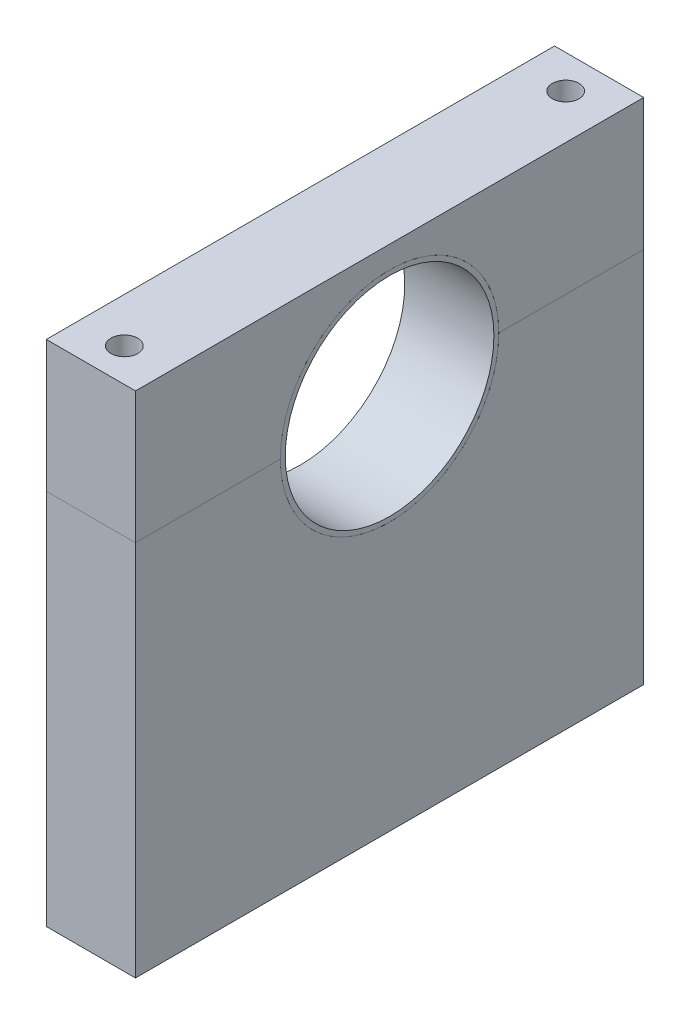
ISO-10303-21;
HEADER;
FILE_DESCRIPTION(('STEP AP214'),'2;1');
FILE_NAME('part.step','',(''),(''),'','','');
FILE_SCHEMA(('AUTOMOTIVE_DESIGN { 1 0 10303 214 1 1 1 1 }'));
ENDSEC;
DATA;
#1=APPLICATION_CONTEXT('core data for automotive mechanical design processes');
#2=APPLICATION_PROTOCOL_DEFINITION('international standard','automotive_design',2000,#1);
#3=PRODUCT_CONTEXT('',#1,'mechanical');
#4=PRODUCT('Part','Part','',(#3));
#5=PRODUCT_RELATED_PRODUCT_CATEGORY('part','',(#4));
#6=PRODUCT_DEFINITION_FORMATION('','',#4);
#7=PRODUCT_DEFINITION_CONTEXT('part definition',#1,'design');
#8=PRODUCT_DEFINITION('design','',#6,#7);
#9=PRODUCT_DEFINITION_SHAPE('','',#8);
#10=(LENGTH_UNIT() NAMED_UNIT(*) SI_UNIT(.MILLI.,.METRE.));
#11=(NAMED_UNIT(*) PLANE_ANGLE_UNIT() SI_UNIT($,.RADIAN.));
#12=(NAMED_UNIT(*) SI_UNIT($,.STERADIAN.) SOLID_ANGLE_UNIT());
#13=UNCERTAINTY_MEASURE_WITH_UNIT(LENGTH_MEASURE(1.E-05),#10,'distance_accuracy_value','');
#14=(GEOMETRIC_REPRESENTATION_CONTEXT(3) GLOBAL_UNCERTAINTY_ASSIGNED_CONTEXT((#13)) GLOBAL_UNIT_ASSIGNED_CONTEXT((#10,
#11,#12)) REPRESENTATION_CONTEXT('',''));
#15=CARTESIAN_POINT('',(0.,0.,0.));
#16=DIRECTION('',(0.,0.,1.));
#17=DIRECTION('',(1.,0.,0.));
#18=AXIS2_PLACEMENT_3D('',#15,#16,#17);
#19=CARTESIAN_POINT('',(-49.0790267287324,0.,0.));
#20=DIRECTION('',(-1.,0.,0.));
#21=DIRECTION('',(0.,-1.,0.));
#22=AXIS2_PLACEMENT_3D('',#19,#20,#21);
#23=PLANE('',#22);
#24=DIRECTION('',(0.,0.,1.));
#25=VECTOR('',#24,1.);
#26=CARTESIAN_POINT('',(-49.0790267287324,10.5481794760951,0.));
#27=LINE('',#26,#25);
#28=CARTESIAN_POINT('',(-49.0790267287324,10.5481794760951,24.5));
#29=VERTEX_POINT('',#28);
#30=CARTESIAN_POINT('',(-49.0790267287324,10.5481794760951,57.));
#31=VERTEX_POINT('',#30);
#32=EDGE_CURVE('E136',#29,#31,#27,.T.);
#33=ORIENTED_EDGE('',*,*,#32,.F.);
#34=CARTESIAN_POINT('',(-49.0790267287324,10.5481794760951,0.));
#35=DIRECTION('',(-1.,0.,0.));
#36=DIRECTION('',(0.,-1.,0.));
#37=AXIS2_PLACEMENT_3D('',#34,#35,#36);
#38=CIRCLE('',#37,24.5);
#39=CARTESIAN_POINT('',(-49.0790267287324,10.5481794760951,-24.5));
#40=VERTEX_POINT('',#39);
#41=EDGE_CURVE('E143',#40,#29,#38,.T.);
#42=ORIENTED_EDGE('',*,*,#41,.F.);
#43=DIRECTION('',(0.,0.,-1.));
#44=VECTOR('',#43,1.);
#45=CARTESIAN_POINT('',(-49.0790267287324,10.5481794760951,0.));
#46=LINE('',#45,#44);
#47=CARTESIAN_POINT('',(-49.0790267287324,10.5481794760951,-57.));
#48=VERTEX_POINT('',#47);
#49=EDGE_CURVE('E108',#40,#48,#46,.T.);
#50=ORIENTED_EDGE('',*,*,#49,.T.);
#51=DIRECTION('',(0.,1.,0.));
#52=VECTOR('',#51,1.);
#53=CARTESIAN_POINT('',(-49.0790267287324,0.,-57.));
#54=LINE('',#53,#52);
#55=CARTESIAN_POINT('',(-49.0790267287324,-74.001820523905,-57.));
#56=VERTEX_POINT('',#55);
#57=EDGE_CURVE('E100',#56,#48,#54,.T.);
#58=ORIENTED_EDGE('',*,*,#57,.F.);
#59=DIRECTION('',(0.,0.,-1.));
#60=VECTOR('',#59,1.);
#61=CARTESIAN_POINT('',(-49.0790267287324,-74.001820523905,57.));
#62=LINE('',#61,#60);
#63=CARTESIAN_POINT('',(-49.0790267287324,-74.001820523905,57.));
#64=VERTEX_POINT('',#63);
#65=EDGE_CURVE('E105',#64,#56,#62,.T.);
#66=ORIENTED_EDGE('',*,*,#65,.F.);
#67=DIRECTION('',(0.,1.,0.));
#68=VECTOR('',#67,1.);
#69=CARTESIAN_POINT('',(-49.0790267287324,0.,57.));
#70=LINE('',#69,#68);
#71=EDGE_CURVE('E110',#64,#31,#70,.T.);
#72=ORIENTED_EDGE('',*,*,#71,.T.);
#73=EDGE_LOOP('',(#33,#42,#50,#58,#66,#72));
#74=FACE_BOUND('',#73,.T.);
#75=ADVANCED_FACE('F46',(#74),#23,.T.);
#76=CARTESIAN_POINT('',(88.6760156261493,10.5481794760951,0.));
#77=DIRECTION('',(-1.,0.,0.));
#78=DIRECTION('',(0.,-1.,0.));
#79=AXIS2_PLACEMENT_3D('',#76,#77,#78);
#80=CYLINDRICAL_SURFACE('',#79,24.5);
#81=DIRECTION('',(-1.,0.,0.));
#82=VECTOR('',#81,1.);
#83=CARTESIAN_POINT('',(88.6760156261493,10.5481794760951,24.5));
#84=LINE('',#83,#82);
#85=CARTESIAN_POINT('',(-29.0790267287325,10.5481794760951,24.5));
#86=VERTEX_POINT('',#85);
#87=EDGE_CURVE('E148',#86,#29,#84,.T.);
#88=ORIENTED_EDGE('',*,*,#87,.F.);
#89=CARTESIAN_POINT('',(-29.0790267287325,10.5481794760951,0.));
#90=DIRECTION('',(-1.,0.,0.));
#91=DIRECTION('',(0.,0.,1.));
#92=AXIS2_PLACEMENT_3D('',#89,#90,#91);
#93=CIRCLE('',#92,24.5);
#94=CARTESIAN_POINT('',(-29.0790267287325,10.5481794760951,-24.5));
#95=VERTEX_POINT('',#94);
#96=EDGE_CURVE('E69',#86,#95,#93,.F.);
#97=ORIENTED_EDGE('',*,*,#96,.T.);
#98=DIRECTION('',(-1.,0.,0.));
#99=VECTOR('',#98,1.);
#100=CARTESIAN_POINT('',(88.6760156261493,10.5481794760951,-24.5));
#101=LINE('',#100,#99);
#102=EDGE_CURVE('E153',#95,#40,#101,.T.);
#103=ORIENTED_EDGE('',*,*,#102,.T.);
#104=ORIENTED_EDGE('',*,*,#41,.T.);
#105=EDGE_LOOP('',(#88,#97,#103,#104));
#106=FACE_BOUND('',#105,.T.);
#107=ADVANCED_FACE('F157',(#106),#80,.F.);
#108=CARTESIAN_POINT('',(88.6760156261493,10.5481794760951,0.));
#109=DIRECTION('',(0.,1.,0.));
#110=DIRECTION('',(-1.,0.,0.));
#111=AXIS2_PLACEMENT_3D('',#108,#109,#110);
#112=PLANE('',#111);
#113=CARTESIAN_POINT('',(-39.0790267287324,10.5481794760951,-49.5));
#114=DIRECTION('',(0.,1.,0.));
#115=DIRECTION('',(-1.,0.,0.));
#116=AXIS2_PLACEMENT_3D('',#113,#114,#115);
#117=CIRCLE('',#116,3.);
#118=CARTESIAN_POINT('',(-42.0790267287325,10.5481794760951,-49.5));
#119=VERTEX_POINT('',#118);
#120=EDGE_CURVE('E133',#119,#119,#117,.T.);
#121=ORIENTED_EDGE('',*,*,#120,.F.);
#122=EDGE_LOOP('',(#121));
#123=FACE_BOUND('',#122,.T.);
#124=DIRECTION('',(0.,0.,1.));
#125=VECTOR('',#124,1.);
#126=CARTESIAN_POINT('',(-29.0790267287325,10.5481794760951,0.));
#127=LINE('',#126,#125);
#128=CARTESIAN_POINT('',(-29.0790267287325,10.5481794760951,-57.));
#129=VERTEX_POINT('',#128);
#130=EDGE_CURVE('E137',#129,#95,#127,.T.);
#131=ORIENTED_EDGE('',*,*,#130,.F.);
#132=DIRECTION('',(-1.,0.,0.));
#133=VECTOR('',#132,1.);
#134=CARTESIAN_POINT('',(88.6760156261493,10.5481794760951,-57.));
#135=LINE('',#134,#133);
#136=EDGE_CURVE('E151',#129,#48,#135,.T.);
#137=ORIENTED_EDGE('',*,*,#136,.T.);
#138=ORIENTED_EDGE('',*,*,#49,.F.);
#139=ORIENTED_EDGE('',*,*,#102,.F.);
#140=EDGE_LOOP('',(#131,#137,#138,#139));
#141=FACE_BOUND('',#140,.T.);
#142=ADVANCED_FACE('F167',(#123,#141),#112,.T.);
#143=CARTESIAN_POINT('',(88.6760156261493,0.,-57.));
#144=DIRECTION('',(0.,0.,1.));
#145=DIRECTION('',(0.,-1.,0.));
#146=AXIS2_PLACEMENT_3D('',#143,#144,#145);
#147=PLANE('',#146);
#148=ORIENTED_EDGE('',*,*,#136,.F.);
#149=DIRECTION('',(0.,-1.,0.));
#150=VECTOR('',#149,1.);
#151=CARTESIAN_POINT('',(-29.0790267287325,0.,-57.));
#152=LINE('',#151,#150);
#153=CARTESIAN_POINT('',(-29.0790267287324,-74.001820523905,-57.));
#154=VERTEX_POINT('',#153);
#155=EDGE_CURVE('E63',#129,#154,#152,.T.);
#156=ORIENTED_EDGE('',*,*,#155,.T.);
#157=DIRECTION('',(1.,0.,0.));
#158=VECTOR('',#157,1.);
#159=CARTESIAN_POINT('',(-49.0790267287324,-74.001820523905,-57.));
#160=LINE('',#159,#158);
#161=EDGE_CURVE('E113',#56,#154,#160,.T.);
#162=ORIENTED_EDGE('',*,*,#161,.F.);
#163=ORIENTED_EDGE('',*,*,#57,.T.);
#164=EDGE_LOOP('',(#148,#156,#162,#163));
#165=FACE_BOUND('',#164,.T.);
#166=ADVANCED_FACE('F114',(#165),#147,.F.);
#167=CARTESIAN_POINT('',(88.6760156261493,0.,57.));
#168=DIRECTION('',(0.,0.,1.));
#169=DIRECTION('',(1.,0.,0.));
#170=AXIS2_PLACEMENT_3D('',#167,#168,#169);
#171=PLANE('',#170);
#172=DIRECTION('',(0.,-1.,0.));
#173=VECTOR('',#172,1.);
#174=CARTESIAN_POINT('',(-29.0790267287325,0.,57.));
#175=LINE('',#174,#173);
#176=CARTESIAN_POINT('',(-29.0790267287325,10.5481794760951,57.));
#177=VERTEX_POINT('',#176);
#178=CARTESIAN_POINT('',(-29.0790267287324,-74.0018205239049,57.));
#179=VERTEX_POINT('',#178);
#180=EDGE_CURVE('E55',#177,#179,#175,.T.);
#181=ORIENTED_EDGE('',*,*,#180,.F.);
#182=DIRECTION('',(-1.,0.,0.));
#183=VECTOR('',#182,1.);
#184=CARTESIAN_POINT('',(88.6760156261493,10.5481794760951,57.));
#185=LINE('',#184,#183);
#186=EDGE_CURVE('E149',#177,#31,#185,.T.);
#187=ORIENTED_EDGE('',*,*,#186,.T.);
#188=ORIENTED_EDGE('',*,*,#71,.F.);
#189=DIRECTION('',(-1.,0.,0.));
#190=VECTOR('',#189,1.);
#191=CARTESIAN_POINT('',(-49.0790267287324,-74.001820523905,57.));
#192=LINE('',#191,#190);
#193=EDGE_CURVE('E123',#179,#64,#192,.T.);
#194=ORIENTED_EDGE('',*,*,#193,.F.);
#195=EDGE_LOOP('',(#181,#187,#188,#194));
#196=FACE_BOUND('',#195,.T.);
#197=ADVANCED_FACE('F164',(#196),#171,.T.);
#198=CARTESIAN_POINT('',(88.6760156261493,10.5481794760951,0.));
#199=DIRECTION('',(0.,-1.,0.));
#200=DIRECTION('',(1.,0.,0.));
#201=AXIS2_PLACEMENT_3D('',#198,#199,#200);
#202=PLANE('',#201);
#203=CARTESIAN_POINT('',(-39.0790267287324,10.5481794760951,49.5));
#204=DIRECTION('',(0.,-1.,0.));
#205=DIRECTION('',(1.,0.,0.));
#206=AXIS2_PLACEMENT_3D('',#203,#204,#205);
#207=CIRCLE('',#206,3.);
#208=CARTESIAN_POINT('',(-36.0790267287324,10.5481794760951,49.5));
#209=VERTEX_POINT('',#208);
#210=EDGE_CURVE('E50',#209,#209,#207,.T.);
#211=ORIENTED_EDGE('',*,*,#210,.T.);
#212=EDGE_LOOP('',(#211));
#213=FACE_BOUND('',#212,.T.);
#214=ORIENTED_EDGE('',*,*,#186,.F.);
#215=DIRECTION('',(0.,0.,-1.));
#216=VECTOR('',#215,1.);
#217=CARTESIAN_POINT('',(-29.0790267287325,10.5481794760951,0.));
#218=LINE('',#217,#216);
#219=EDGE_CURVE('E12',#177,#86,#218,.T.);
#220=ORIENTED_EDGE('',*,*,#219,.T.);
#221=ORIENTED_EDGE('',*,*,#87,.T.);
#222=ORIENTED_EDGE('',*,*,#32,.T.);
#223=EDGE_LOOP('',(#214,#220,#221,#222));
#224=FACE_BOUND('',#223,.T.);
#225=ADVANCED_FACE('F48',(#213,#224),#202,.F.);
#226=CARTESIAN_POINT('',(-29.0790267287325,25.0481794760951,0.));
#227=DIRECTION('',(-1.,0.,0.));
#228=DIRECTION('',(0.,0.,1.));
#229=AXIS2_PLACEMENT_3D('',#226,#227,#228);
#230=PLANE('',#229);
#231=ORIENTED_EDGE('',*,*,#180,.T.);
#232=DIRECTION('',(0.,0.,1.));
#233=VECTOR('',#232,1.);
#234=CARTESIAN_POINT('',(-29.0790267287324,-74.0018205239049,57.));
#235=LINE('',#234,#233);
#236=EDGE_CURVE('E117',#154,#179,#235,.T.);
#237=ORIENTED_EDGE('',*,*,#236,.F.);
#238=ORIENTED_EDGE('',*,*,#155,.F.);
#239=ORIENTED_EDGE('',*,*,#130,.T.);
#240=ORIENTED_EDGE('',*,*,#96,.F.);
#241=ORIENTED_EDGE('',*,*,#219,.F.);
#242=EDGE_LOOP('',(#231,#237,#238,#239,#240,#241));
#243=FACE_BOUND('',#242,.T.);
#244=ADVANCED_FACE('F162',(#243),#230,.F.);
#245=CARTESIAN_POINT('',(-39.0790267287324,-27.4371018981435,49.5));
#246=DIRECTION('',(0.,1.,0.));
#247=DIRECTION('',(-1.,0.,0.));
#248=AXIS2_PLACEMENT_3D('',#245,#246,#247);
#249=CYLINDRICAL_SURFACE('',#248,3.);
#250=ORIENTED_EDGE('',*,*,#210,.F.);
#251=EDGE_LOOP('',(#250));
#252=FACE_BOUND('',#251,.T.);
#253=CARTESIAN_POINT('',(-39.0790267287324,-74.001820523905,49.5));
#254=DIRECTION('',(0.,-1.,0.));
#255=DIRECTION('',(1.,0.,0.));
#256=AXIS2_PLACEMENT_3D('',#253,#254,#255);
#257=CIRCLE('',#256,3.);
#258=CARTESIAN_POINT('',(-36.0790267287324,-74.001820523905,49.5));
#259=VERTEX_POINT('',#258);
#260=EDGE_CURVE('E124',#259,#259,#257,.T.);
#261=ORIENTED_EDGE('',*,*,#260,.T.);
#262=EDGE_LOOP('',(#261));
#263=FACE_BOUND('',#262,.T.);
#264=ADVANCED_FACE('F192',(#252,#263),#249,.F.);
#265=CARTESIAN_POINT('',(-39.0790267287324,-27.4371018981436,-49.5));
#266=DIRECTION('',(0.,1.,0.));
#267=DIRECTION('',(-1.,0.,0.));
#268=AXIS2_PLACEMENT_3D('',#265,#266,#267);
#269=CYLINDRICAL_SURFACE('',#268,3.);
#270=ORIENTED_EDGE('',*,*,#120,.T.);
#271=EDGE_LOOP('',(#270));
#272=FACE_BOUND('',#271,.T.);
#273=CARTESIAN_POINT('',(-39.0790267287324,-74.001820523905,-49.5));
#274=DIRECTION('',(0.,-1.,0.));
#275=DIRECTION('',(1.,0.,0.));
#276=AXIS2_PLACEMENT_3D('',#273,#274,#275);
#277=CIRCLE('',#276,3.);
#278=CARTESIAN_POINT('',(-36.0790267287324,-74.001820523905,-49.5));
#279=VERTEX_POINT('',#278);
#280=EDGE_CURVE('E127',#279,#279,#277,.T.);
#281=ORIENTED_EDGE('',*,*,#280,.T.);
#282=EDGE_LOOP('',(#281));
#283=FACE_BOUND('',#282,.T.);
#284=ADVANCED_FACE('F198',(#272,#283),#269,.F.);
#285=CARTESIAN_POINT('',(0.,-74.0018205239049,0.));
#286=DIRECTION('',(0.,-1.,0.));
#287=DIRECTION('',(1.,0.,0.));
#288=AXIS2_PLACEMENT_3D('',#285,#286,#287);
#289=PLANE('',#288);
#290=ORIENTED_EDGE('',*,*,#260,.F.);
#291=EDGE_LOOP('',(#290));
#292=FACE_BOUND('',#291,.T.);
#293=ORIENTED_EDGE('',*,*,#65,.T.);
#294=ORIENTED_EDGE('',*,*,#161,.T.);
#295=ORIENTED_EDGE('',*,*,#236,.T.);
#296=ORIENTED_EDGE('',*,*,#193,.T.);
#297=EDGE_LOOP('',(#293,#294,#295,#296));
#298=FACE_BOUND('',#297,.T.);
#299=ORIENTED_EDGE('',*,*,#280,.F.);
#300=EDGE_LOOP('',(#299));
#301=FACE_BOUND('',#300,.T.);
#302=ADVANCED_FACE('F120',(#292,#298,#301),#289,.T.);
#303=CLOSED_SHELL('',(#75,#107,#142,#166,#197,#225,#244,#264,#284,#302));
#304=MANIFOLD_SOLID_BREP('B2',#303);
#305=CARTESIAN_POINT('',(88.6760156261493,10.5481794760951,0.));
#306=DIRECTION('',(-1.,0.,0.));
#307=DIRECTION('',(0.,-1.,0.));
#308=AXIS2_PLACEMENT_3D('',#305,#306,#307);
#309=CYLINDRICAL_SURFACE('',#308,24.5);
#310=DIRECTION('',(-1.,0.,0.));
#311=VECTOR('',#310,1.);
#312=CARTESIAN_POINT('',(88.6760156261493,10.5481794760951,-24.5));
#313=LINE('',#312,#311);
#314=CARTESIAN_POINT('',(-29.0790267287325,10.5481794760951,-24.5));
#315=VERTEX_POINT('',#314);
#316=CARTESIAN_POINT('',(-49.0790267287324,10.5481794760951,-24.5));
#317=VERTEX_POINT('',#316);
#318=EDGE_CURVE('E375',#315,#317,#313,.T.);
#319=ORIENTED_EDGE('',*,*,#318,.F.);
#320=CARTESIAN_POINT('',(-29.0790267287325,10.5481794760951,0.));
#321=DIRECTION('',(-1.,0.,0.));
#322=DIRECTION('',(0.,0.,1.));
#323=AXIS2_PLACEMENT_3D('',#320,#321,#322);
#324=CIRCLE('',#323,24.5);
#325=CARTESIAN_POINT('',(-29.0790267287325,10.5481794760951,24.5));
#326=VERTEX_POINT('',#325);
#327=EDGE_CURVE('E297',#315,#326,#324,.F.);
#328=ORIENTED_EDGE('',*,*,#327,.T.);
#329=DIRECTION('',(-1.,0.,0.));
#330=VECTOR('',#329,1.);
#331=CARTESIAN_POINT('',(88.6760156261493,10.5481794760951,24.5));
#332=LINE('',#331,#330);
#333=CARTESIAN_POINT('',(-49.0790267287324,10.5481794760951,24.5));
#334=VERTEX_POINT('',#333);
#335=EDGE_CURVE('E340',#326,#334,#332,.T.);
#336=ORIENTED_EDGE('',*,*,#335,.T.);
#337=CARTESIAN_POINT('',(-49.0790267287324,10.5481794760951,0.));
#338=DIRECTION('',(-1.,0.,0.));
#339=DIRECTION('',(0.,-1.,0.));
#340=AXIS2_PLACEMENT_3D('',#337,#338,#339);
#341=CIRCLE('',#340,24.5);
#342=EDGE_CURVE('E343',#334,#317,#341,.T.);
#343=ORIENTED_EDGE('',*,*,#342,.T.);
#344=EDGE_LOOP('',(#319,#328,#336,#343));
#345=FACE_BOUND('',#344,.T.);
#346=ADVANCED_FACE('F289',(#345),#309,.F.);
#347=CARTESIAN_POINT('',(88.6760156261493,10.5481794760951,0.));
#348=DIRECTION('',(0.,1.,0.));
#349=DIRECTION('',(-1.,0.,0.));
#350=AXIS2_PLACEMENT_3D('',#347,#348,#349);
#351=PLANE('',#350);
#352=CARTESIAN_POINT('',(-39.0790267287324,10.5481794760951,-49.5));
#353=DIRECTION('',(0.,1.,0.));
#354=DIRECTION('',(-1.,0.,0.));
#355=AXIS2_PLACEMENT_3D('',#352,#353,#354);
#356=CIRCLE('',#355,3.);
#357=CARTESIAN_POINT('',(-42.0790267287325,10.5481794760951,-49.5));
#358=VERTEX_POINT('',#357);
#359=EDGE_CURVE('E358',#358,#358,#356,.T.);
#360=ORIENTED_EDGE('',*,*,#359,.T.);
#361=EDGE_LOOP('',(#360));
#362=FACE_BOUND('',#361,.T.);
#363=DIRECTION('',(-1.,0.,0.));
#364=VECTOR('',#363,1.);
#365=CARTESIAN_POINT('',(88.6760156261493,10.5481794760951,-57.));
#366=LINE('',#365,#364);
#367=CARTESIAN_POINT('',(-29.0790267287325,10.5481794760951,-57.));
#368=VERTEX_POINT('',#367);
#369=CARTESIAN_POINT('',(-49.0790267287324,10.5481794760951,-57.));
#370=VERTEX_POINT('',#369);
#371=EDGE_CURVE('E378',#368,#370,#366,.T.);
#372=ORIENTED_EDGE('',*,*,#371,.F.);
#373=DIRECTION('',(0.,0.,1.));
#374=VECTOR('',#373,1.);
#375=CARTESIAN_POINT('',(-29.0790267287325,10.5481794760951,0.));
#376=LINE('',#375,#374);
#377=EDGE_CURVE('E304',#368,#315,#376,.T.);
#378=ORIENTED_EDGE('',*,*,#377,.T.);
#379=ORIENTED_EDGE('',*,*,#318,.T.);
#380=DIRECTION('',(0.,0.,-1.));
#381=VECTOR('',#380,1.);
#382=CARTESIAN_POINT('',(-49.0790267287324,10.5481794760951,0.));
#383=LINE('',#382,#381);
#384=EDGE_CURVE('E348',#317,#370,#383,.T.);
#385=ORIENTED_EDGE('',*,*,#384,.T.);
#386=EDGE_LOOP('',(#372,#378,#379,#385));
#387=FACE_BOUND('',#386,.T.);
#388=ADVANCED_FACE('F396',(#362,#387),#351,.F.);
#389=CARTESIAN_POINT('',(88.6760156261493,0.,-57.));
#390=DIRECTION('',(0.,0.,1.));
#391=DIRECTION('',(0.,-1.,0.));
#392=AXIS2_PLACEMENT_3D('',#389,#390,#391);
#393=PLANE('',#392);
#394=DIRECTION('',(-1.,0.,0.));
#395=VECTOR('',#394,1.);
#396=CARTESIAN_POINT('',(88.6760156261493,40.0481794760952,-57.));
#397=LINE('',#396,#395);
#398=CARTESIAN_POINT('',(-29.0790267287324,40.0481794760951,-57.));
#399=VERTEX_POINT('',#398);
#400=CARTESIAN_POINT('',(-49.0790267287325,40.0481794760951,-57.));
#401=VERTEX_POINT('',#400);
#402=EDGE_CURVE('E380',#399,#401,#397,.T.);
#403=ORIENTED_EDGE('',*,*,#402,.F.);
#404=DIRECTION('',(0.,-1.,0.));
#405=VECTOR('',#404,1.);
#406=CARTESIAN_POINT('',(-29.0790267287325,0.,-57.));
#407=LINE('',#406,#405);
#408=EDGE_CURVE('E308',#399,#368,#407,.T.);
#409=ORIENTED_EDGE('',*,*,#408,.T.);
#410=ORIENTED_EDGE('',*,*,#371,.T.);
#411=DIRECTION('',(0.,1.,0.));
#412=VECTOR('',#411,1.);
#413=CARTESIAN_POINT('',(-49.0790267287324,0.,-57.));
#414=LINE('',#413,#412);
#415=EDGE_CURVE('E371',#370,#401,#414,.T.);
#416=ORIENTED_EDGE('',*,*,#415,.T.);
#417=EDGE_LOOP('',(#403,#409,#410,#416));
#418=FACE_BOUND('',#417,.T.);
#419=ADVANCED_FACE('F393',(#418),#393,.F.);
#420=CARTESIAN_POINT('',(88.6760156261493,40.0481794760952,0.));
#421=DIRECTION('',(0.,-1.,0.));
#422=DIRECTION('',(1.,0.,0.));
#423=AXIS2_PLACEMENT_3D('',#420,#421,#422);
#424=PLANE('',#423);
#425=CARTESIAN_POINT('',(-39.0790267287325,40.0481794760951,-49.5));
#426=DIRECTION('',(0.,1.,0.));
#427=DIRECTION('',(-1.,0.,0.));
#428=AXIS2_PLACEMENT_3D('',#425,#426,#427);
#429=CIRCLE('',#428,3.);
#430=CARTESIAN_POINT('',(-42.0790267287325,40.0481794760951,-49.5));
#431=VERTEX_POINT('',#430);
#432=EDGE_CURVE('E408',#431,#431,#429,.T.);
#433=ORIENTED_EDGE('',*,*,#432,.F.);
#434=EDGE_LOOP('',(#433));
#435=FACE_BOUND('',#434,.T.);
#436=CARTESIAN_POINT('',(-39.0790267287325,40.0481794760951,49.5));
#437=DIRECTION('',(0.,1.,0.));
#438=DIRECTION('',(-1.,0.,0.));
#439=AXIS2_PLACEMENT_3D('',#436,#437,#438);
#440=CIRCLE('',#439,3.);
#441=CARTESIAN_POINT('',(-42.0790267287325,40.0481794760951,49.5));
#442=VERTEX_POINT('',#441);
#443=EDGE_CURVE('E405',#442,#442,#440,.T.);
#444=ORIENTED_EDGE('',*,*,#443,.F.);
#445=EDGE_LOOP('',(#444));
#446=FACE_BOUND('',#445,.T.);
#447=DIRECTION('',(-1.,0.,0.));
#448=VECTOR('',#447,1.);
#449=CARTESIAN_POINT('',(88.6760156261493,40.0481794760952,57.));
#450=LINE('',#449,#448);
#451=CARTESIAN_POINT('',(-29.0790267287325,40.0481794760952,57.));
#452=VERTEX_POINT('',#451);
#453=CARTESIAN_POINT('',(-49.0790267287325,40.0481794760951,57.));
#454=VERTEX_POINT('',#453);
#455=EDGE_CURVE('E382',#452,#454,#450,.T.);
#456=ORIENTED_EDGE('',*,*,#455,.F.);
#457=DIRECTION('',(0.,0.,-1.));
#458=VECTOR('',#457,1.);
#459=CARTESIAN_POINT('',(-29.0790267287324,40.0481794760951,0.));
#460=LINE('',#459,#458);
#461=EDGE_CURVE('E398',#452,#399,#460,.T.);
#462=ORIENTED_EDGE('',*,*,#461,.T.);
#463=ORIENTED_EDGE('',*,*,#402,.T.);
#464=DIRECTION('',(0.,0.,1.));
#465=VECTOR('',#464,1.);
#466=CARTESIAN_POINT('',(-49.0790267287325,40.0481794760951,0.));
#467=LINE('',#466,#465);
#468=EDGE_CURVE('E365',#401,#454,#467,.T.);
#469=ORIENTED_EDGE('',*,*,#468,.T.);
#470=EDGE_LOOP('',(#456,#462,#463,#469));
#471=FACE_BOUND('',#470,.T.);
#472=ADVANCED_FACE('F390',(#435,#446,#471),#424,.F.);
#473=CARTESIAN_POINT('',(88.6760156261493,0.,57.));
#474=DIRECTION('',(0.,0.,1.));
#475=DIRECTION('',(1.,0.,0.));
#476=AXIS2_PLACEMENT_3D('',#473,#474,#475);
#477=PLANE('',#476);
#478=DIRECTION('',(0.,-1.,0.));
#479=VECTOR('',#478,1.);
#480=CARTESIAN_POINT('',(-29.0790267287325,0.,57.));
#481=LINE('',#480,#479);
#482=CARTESIAN_POINT('',(-29.0790267287325,10.5481794760951,57.));
#483=VERTEX_POINT('',#482);
#484=EDGE_CURVE('E377',#452,#483,#481,.T.);
#485=ORIENTED_EDGE('',*,*,#484,.F.);
#486=ORIENTED_EDGE('',*,*,#455,.T.);
#487=DIRECTION('',(0.,1.,0.));
#488=VECTOR('',#487,1.);
#489=CARTESIAN_POINT('',(-49.0790267287324,0.,57.));
#490=LINE('',#489,#488);
#491=CARTESIAN_POINT('',(-49.0790267287324,10.5481794760951,57.));
#492=VERTEX_POINT('',#491);
#493=EDGE_CURVE('E363',#492,#454,#490,.T.);
#494=ORIENTED_EDGE('',*,*,#493,.F.);
#495=DIRECTION('',(-1.,0.,0.));
#496=VECTOR('',#495,1.);
#497=CARTESIAN_POINT('',(88.6760156261493,10.5481794760951,57.));
#498=LINE('',#497,#496);
#499=EDGE_CURVE('E347',#483,#492,#498,.T.);
#500=ORIENTED_EDGE('',*,*,#499,.F.);
#501=EDGE_LOOP('',(#485,#486,#494,#500));
#502=FACE_BOUND('',#501,.T.);
#503=ADVANCED_FACE('F387',(#502),#477,.T.);
#504=CARTESIAN_POINT('',(88.6760156261493,10.5481794760951,0.));
#505=DIRECTION('',(0.,-1.,0.));
#506=DIRECTION('',(1.,0.,0.));
#507=AXIS2_PLACEMENT_3D('',#504,#505,#506);
#508=PLANE('',#507);
#509=CARTESIAN_POINT('',(-39.0790267287324,10.5481794760951,49.5));
#510=DIRECTION('',(0.,-1.,0.));
#511=DIRECTION('',(1.,0.,0.));
#512=AXIS2_PLACEMENT_3D('',#509,#510,#511);
#513=CIRCLE('',#512,3.);
#514=CARTESIAN_POINT('',(-36.0790267287324,10.5481794760951,49.5));
#515=VERTEX_POINT('',#514);
#516=EDGE_CURVE('E292',#515,#515,#513,.T.);
#517=ORIENTED_EDGE('',*,*,#516,.F.);
#518=EDGE_LOOP('',(#517));
#519=FACE_BOUND('',#518,.T.);
#520=DIRECTION('',(0.,0.,-1.));
#521=VECTOR('',#520,1.);
#522=CARTESIAN_POINT('',(-29.0790267287325,10.5481794760951,0.));
#523=LINE('',#522,#521);
#524=EDGE_CURVE('E44',#483,#326,#523,.T.);
#525=ORIENTED_EDGE('',*,*,#524,.F.);
#526=ORIENTED_EDGE('',*,*,#499,.T.);
#527=DIRECTION('',(0.,0.,1.));
#528=VECTOR('',#527,1.);
#529=CARTESIAN_POINT('',(-49.0790267287324,10.5481794760951,0.));
#530=LINE('',#529,#528);
#531=EDGE_CURVE('E355',#334,#492,#530,.T.);
#532=ORIENTED_EDGE('',*,*,#531,.F.);
#533=ORIENTED_EDGE('',*,*,#335,.F.);
#534=EDGE_LOOP('',(#525,#526,#532,#533));
#535=FACE_BOUND('',#534,.T.);
#536=ADVANCED_FACE('F360',(#519,#535),#508,.T.);
#537=CARTESIAN_POINT('',(-49.0790267287324,0.,0.));
#538=DIRECTION('',(-1.,0.,0.));
#539=DIRECTION('',(0.,-1.,0.));
#540=AXIS2_PLACEMENT_3D('',#537,#538,#539);
#541=PLANE('',#540);
#542=ORIENTED_EDGE('',*,*,#342,.F.);
#543=ORIENTED_EDGE('',*,*,#531,.T.);
#544=ORIENTED_EDGE('',*,*,#493,.T.);
#545=ORIENTED_EDGE('',*,*,#468,.F.);
#546=ORIENTED_EDGE('',*,*,#415,.F.);
#547=ORIENTED_EDGE('',*,*,#384,.F.);
#548=EDGE_LOOP('',(#542,#543,#544,#545,#546,#547));
#549=FACE_BOUND('',#548,.T.);
#550=ADVANCED_FACE('F353',(#549),#541,.T.);
#551=CARTESIAN_POINT('',(-29.0790267287325,25.0481794760951,0.));
#552=DIRECTION('',(-1.,0.,0.));
#553=DIRECTION('',(0.,0.,1.));
#554=AXIS2_PLACEMENT_3D('',#551,#552,#553);
#555=PLANE('',#554);
#556=ORIENTED_EDGE('',*,*,#377,.F.);
#557=ORIENTED_EDGE('',*,*,#408,.F.);
#558=ORIENTED_EDGE('',*,*,#461,.F.);
#559=ORIENTED_EDGE('',*,*,#484,.T.);
#560=ORIENTED_EDGE('',*,*,#524,.T.);
#561=ORIENTED_EDGE('',*,*,#327,.F.);
#562=EDGE_LOOP('',(#556,#557,#558,#559,#560,#561));
#563=FACE_BOUND('',#562,.T.);
#564=ADVANCED_FACE('F423',(#563),#555,.F.);
#565=CARTESIAN_POINT('',(-39.0790267287324,-27.4371018981435,49.5));
#566=DIRECTION('',(0.,1.,0.));
#567=DIRECTION('',(-1.,0.,0.));
#568=AXIS2_PLACEMENT_3D('',#565,#566,#567);
#569=CYLINDRICAL_SURFACE('',#568,3.);
#570=ORIENTED_EDGE('',*,*,#516,.T.);
#571=EDGE_LOOP('',(#570));
#572=FACE_BOUND('',#571,.T.);
#573=ORIENTED_EDGE('',*,*,#443,.T.);
#574=EDGE_LOOP('',(#573));
#575=FACE_BOUND('',#574,.T.);
#576=ADVANCED_FACE('F415',(#572,#575),#569,.F.);
#577=CARTESIAN_POINT('',(-39.0790267287324,-27.4371018981436,-49.5));
#578=DIRECTION('',(0.,1.,0.));
#579=DIRECTION('',(-1.,0.,0.));
#580=AXIS2_PLACEMENT_3D('',#577,#578,#579);
#581=CYLINDRICAL_SURFACE('',#580,3.);
#582=ORIENTED_EDGE('',*,*,#432,.T.);
#583=EDGE_LOOP('',(#582));
#584=FACE_BOUND('',#583,.T.);
#585=ORIENTED_EDGE('',*,*,#359,.F.);
#586=EDGE_LOOP('',(#585));
#587=FACE_BOUND('',#586,.T.);
#588=ADVANCED_FACE('F445',(#584,#587),#581,.F.);
#589=CLOSED_SHELL('',(#346,#388,#419,#472,#503,#536,#550,#564,#576,#588));
#590=MANIFOLD_SOLID_BREP('B6',#589);
#591=CARTESIAN_POINT('',(-29.0790267287325,25.0481794760951,0.));
#592=DIRECTION('',(-1.,0.,0.));
#593=DIRECTION('',(0.,0.,1.));
#594=AXIS2_PLACEMENT_3D('',#591,#592,#593);
#595=PLANE('',#594);
#596=CARTESIAN_POINT('',(-29.0790267287325,10.5481794760951,0.));
#597=DIRECTION('',(1.,0.,0.));
#598=DIRECTION('',(0.,0.,-1.));
#599=AXIS2_PLACEMENT_3D('',#596,#597,#598);
#600=CIRCLE('',#599,23.4);
#601=CARTESIAN_POINT('',(-29.0790267287325,10.5481794760951,-23.4));
#602=VERTEX_POINT('',#601);
#603=EDGE_CURVE('E520',#602,#602,#600,.T.);
#604=ORIENTED_EDGE('',*,*,#603,.F.);
#605=EDGE_LOOP('',(#604));
#606=FACE_BOUND('',#605,.T.);
#607=CARTESIAN_POINT('',(-29.0790267287325,10.5481794760951,0.));
#608=DIRECTION('',(-1.,0.,0.));
#609=DIRECTION('',(0.,0.,1.));
#610=AXIS2_PLACEMENT_3D('',#607,#608,#609);
#611=CIRCLE('',#610,24.5);
#612=CARTESIAN_POINT('',(-29.0790267287325,10.5481794760951,24.5));
#613=VERTEX_POINT('',#612);
#614=EDGE_CURVE('E288',#613,#613,#611,.T.);
#615=ORIENTED_EDGE('',*,*,#614,.F.);
#616=EDGE_LOOP('',(#615));
#617=FACE_BOUND('',#616,.T.);
#618=ADVANCED_FACE('F507',(#606,#617),#595,.F.);
#619=CARTESIAN_POINT('',(-85.0678983106263,10.5481794760951,0.));
#620=DIRECTION('',(-1.,0.,0.));
#621=DIRECTION('',(0.,0.,1.));
#622=AXIS2_PLACEMENT_3D('',#619,#620,#621);
#623=CYLINDRICAL_SURFACE('',#622,24.5);
#624=CARTESIAN_POINT('',(-49.0790267287325,10.5481794760951,0.));
#625=DIRECTION('',(-1.,0.,0.));
#626=DIRECTION('',(0.,0.,1.));
#627=AXIS2_PLACEMENT_3D('',#624,#625,#626);
#628=CIRCLE('',#627,24.5);
#629=CARTESIAN_POINT('',(-49.0790267287325,10.5481794760951,24.5));
#630=VERTEX_POINT('',#629);
#631=EDGE_CURVE('E514',#630,#630,#628,.T.);
#632=ORIENTED_EDGE('',*,*,#631,.F.);
#633=EDGE_LOOP('',(#632));
#634=FACE_BOUND('',#633,.T.);
#635=ORIENTED_EDGE('',*,*,#614,.T.);
#636=EDGE_LOOP('',(#635));
#637=FACE_BOUND('',#636,.T.);
#638=ADVANCED_FACE('F536',(#634,#637),#623,.T.);
#639=CARTESIAN_POINT('',(-49.0790267287324,35.0481794760951,0.));
#640=DIRECTION('',(1.,0.,0.));
#641=DIRECTION('',(0.,0.,-1.));
#642=AXIS2_PLACEMENT_3D('',#639,#640,#641);
#643=PLANE('',#642);
#644=CARTESIAN_POINT('',(-49.0790267287324,10.5481794760951,0.));
#645=DIRECTION('',(1.,0.,0.));
#646=DIRECTION('',(0.,0.,-1.));
#647=AXIS2_PLACEMENT_3D('',#644,#645,#646);
#648=CIRCLE('',#647,23.4);
#649=CARTESIAN_POINT('',(-49.0790267287324,10.5481794760951,-23.4));
#650=VERTEX_POINT('',#649);
#651=EDGE_CURVE('E510',#650,#650,#648,.T.);
#652=ORIENTED_EDGE('',*,*,#651,.T.);
#653=EDGE_LOOP('',(#652));
#654=FACE_BOUND('',#653,.T.);
#655=ORIENTED_EDGE('',*,*,#631,.T.);
#656=EDGE_LOOP('',(#655));
#657=FACE_BOUND('',#656,.T.);
#658=ADVANCED_FACE('F527',(#654,#657),#643,.F.);
#659=CARTESIAN_POINT('',(-63.0790267287325,10.5481794760951,0.));
#660=DIRECTION('',(1.,0.,0.));
#661=DIRECTION('',(0.,0.,-1.));
#662=AXIS2_PLACEMENT_3D('',#659,#660,#661);
#663=CYLINDRICAL_SURFACE('',#662,23.4);
#664=ORIENTED_EDGE('',*,*,#603,.T.);
#665=EDGE_LOOP('',(#664));
#666=FACE_BOUND('',#665,.T.);
#667=ORIENTED_EDGE('',*,*,#651,.F.);
#668=EDGE_LOOP('',(#667));
#669=FACE_BOUND('',#668,.T.);
#670=ADVANCED_FACE('F530',(#666,#669),#663,.F.);
#671=CLOSED_SHELL('',(#618,#638,#658,#670));
#672=MANIFOLD_SOLID_BREP('B38',#671);
#673=ADVANCED_BREP_SHAPE_REPRESENTATION('',(#18,#304,#590,#672),#14);
#674=SHAPE_DEFINITION_REPRESENTATION(#9,#673);
ENDSEC;
END-ISO-10303-21;
